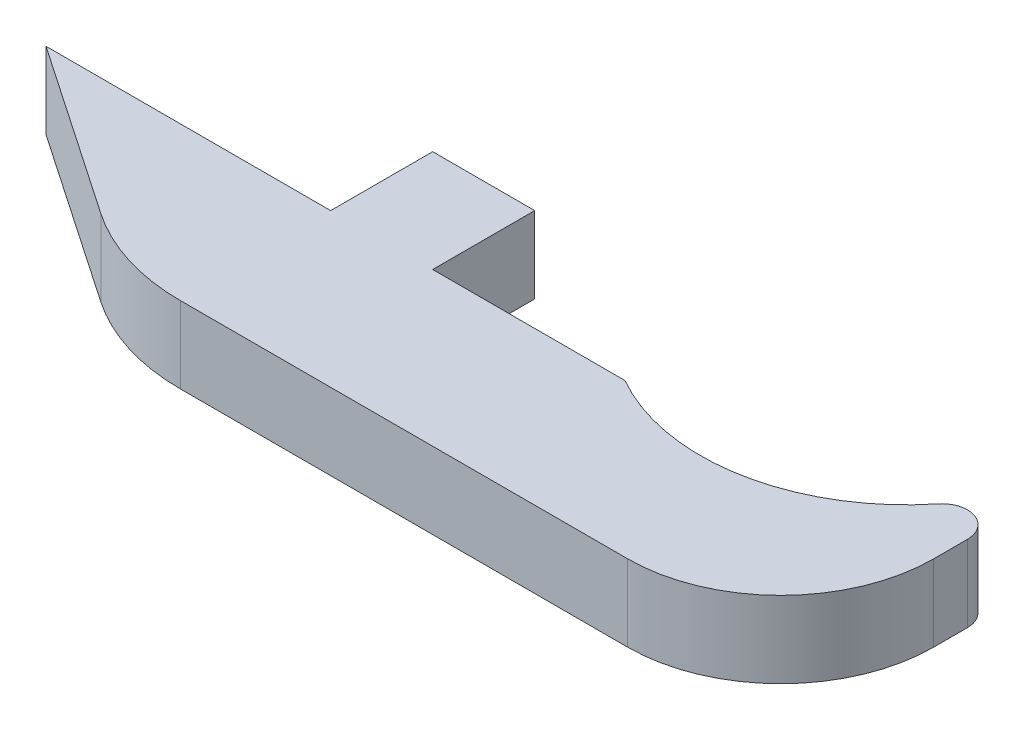
ISO-10303-21;
HEADER;
FILE_DESCRIPTION(('STEP AP214'),'2;1');
FILE_NAME('part.step','',(''),(''),'','','');
FILE_SCHEMA(('AUTOMOTIVE_DESIGN { 1 0 10303 214 1 1 1 1 }'));
ENDSEC;
DATA;
#1=APPLICATION_CONTEXT('core data for automotive mechanical design processes');
#2=APPLICATION_PROTOCOL_DEFINITION('international standard','automotive_design',2000,#1);
#3=PRODUCT_CONTEXT('',#1,'mechanical');
#4=PRODUCT('Part','Part','',(#3));
#5=PRODUCT_RELATED_PRODUCT_CATEGORY('part','',(#4));
#6=PRODUCT_DEFINITION_FORMATION('','',#4);
#7=PRODUCT_DEFINITION_CONTEXT('part definition',#1,'design');
#8=PRODUCT_DEFINITION('design','',#6,#7);
#9=PRODUCT_DEFINITION_SHAPE('','',#8);
#10=(LENGTH_UNIT() NAMED_UNIT(*) SI_UNIT(.MILLI.,.METRE.));
#11=(NAMED_UNIT(*) PLANE_ANGLE_UNIT() SI_UNIT($,.RADIAN.));
#12=(NAMED_UNIT(*) SI_UNIT($,.STERADIAN.) SOLID_ANGLE_UNIT());
#13=UNCERTAINTY_MEASURE_WITH_UNIT(LENGTH_MEASURE(1.E-05),#10,'distance_accuracy_value','');
#14=(GEOMETRIC_REPRESENTATION_CONTEXT(3) GLOBAL_UNCERTAINTY_ASSIGNED_CONTEXT((#13)) GLOBAL_UNIT_ASSIGNED_CONTEXT((#10,
#11,#12)) REPRESENTATION_CONTEXT('',''));
#15=CARTESIAN_POINT('',(0.,0.,0.));
#16=DIRECTION('',(0.,0.,1.));
#17=DIRECTION('',(1.,0.,0.));
#18=AXIS2_PLACEMENT_3D('',#15,#16,#17);
#19=CARTESIAN_POINT('',(0.,4.7625,0.));
#20=DIRECTION('',(0.,0.,1.));
#21=DIRECTION('',(1.,0.,0.));
#22=AXIS2_PLACEMENT_3D('',#19,#20,#21);
#23=PLANE('',#22);
#24=DIRECTION('',(-1.,0.,0.));
#25=VECTOR('',#24,1.);
#26=CARTESIAN_POINT('',(0.,0.,0.));
#27=LINE('',#26,#25);
#28=CARTESIAN_POINT('',(39.2084989263057,0.,0.));
#29=VERTEX_POINT('',#28);
#30=CARTESIAN_POINT('',(27.2395000000017,0.,0.));
#31=VERTEX_POINT('',#30);
#32=EDGE_CURVE('E177',#29,#31,#27,.T.);
#33=ORIENTED_EDGE('',*,*,#32,.T.);
#34=DIRECTION('',(0.,-1.,0.));
#35=VECTOR('',#34,1.);
#36=CARTESIAN_POINT('',(27.2395000000017,4.7625,0.));
#37=LINE('',#36,#35);
#38=CARTESIAN_POINT('',(27.2395000000017,4.7625,0.));
#39=VERTEX_POINT('',#38);
#40=EDGE_CURVE('E58',#39,#31,#37,.T.);
#41=ORIENTED_EDGE('',*,*,#40,.F.);
#42=DIRECTION('',(-1.,0.,0.));
#43=VECTOR('',#42,1.);
#44=CARTESIAN_POINT('',(0.,4.7625,0.));
#45=LINE('',#44,#43);
#46=CARTESIAN_POINT('',(39.2084989263057,4.7625,0.));
#47=VERTEX_POINT('',#46);
#48=EDGE_CURVE('E165',#47,#39,#45,.T.);
#49=ORIENTED_EDGE('',*,*,#48,.F.);
#50=DIRECTION('',(0.,-1.,0.));
#51=VECTOR('',#50,1.);
#52=CARTESIAN_POINT('',(39.2084989263057,4.7625,0.));
#53=LINE('',#52,#51);
#54=EDGE_CURVE('E187',#47,#29,#53,.T.);
#55=ORIENTED_EDGE('',*,*,#54,.T.);
#56=EDGE_LOOP('',(#33,#41,#49,#55));
#57=FACE_BOUND('',#56,.T.);
#58=ADVANCED_FACE('F35',(#57),#23,.F.);
#59=CARTESIAN_POINT('',(45.5929999999997,4.7625,-11.1252));
#60=DIRECTION('',(0.,-1.,0.));
#61=DIRECTION('',(0.,0.,-1.));
#62=AXIS2_PLACEMENT_3D('',#59,#60,#61);
#63=CYLINDRICAL_SURFACE('',#62,12.827);
#64=CARTESIAN_POINT('',(45.5929999999997,4.7625,-11.1252));
#65=DIRECTION('',(0.,1.,0.));
#66=DIRECTION('',(0.,0.,1.));
#67=AXIS2_PLACEMENT_3D('',#64,#65,#66);
#68=CIRCLE('',#67,12.827);
#69=CARTESIAN_POINT('',(55.594669603524,4.7625,-3.09410205875077));
#70=VERTEX_POINT('',#69);
#71=EDGE_CURVE('E161',#47,#70,#68,.T.);
#72=ORIENTED_EDGE('',*,*,#71,.T.);
#73=DIRECTION('',(0.,-1.,0.));
#74=VECTOR('',#73,1.);
#75=CARTESIAN_POINT('',(55.594669603524,4.7625,-3.09410205875077));
#76=LINE('',#75,#74);
#77=CARTESIAN_POINT('',(55.594669603524,0.,-3.09410205875077));
#78=VERTEX_POINT('',#77);
#79=EDGE_CURVE('E201',#70,#78,#76,.T.);
#80=ORIENTED_EDGE('',*,*,#79,.T.);
#81=CARTESIAN_POINT('',(45.5929999999997,0.,-11.1252));
#82=DIRECTION('',(0.,1.,0.));
#83=DIRECTION('',(0.,0.,1.));
#84=AXIS2_PLACEMENT_3D('',#81,#82,#83);
#85=CIRCLE('',#84,12.827);
#86=EDGE_CURVE('E158',#29,#78,#85,.T.);
#87=ORIENTED_EDGE('',*,*,#86,.F.);
#88=ORIENTED_EDGE('',*,*,#54,.F.);
#89=EDGE_LOOP('',(#72,#80,#87,#88));
#90=FACE_BOUND('',#89,.T.);
#91=ADVANCED_FACE('F245',(#90),#63,.F.);
#92=CARTESIAN_POINT('',(20.8895000000017,4.7625,0.));
#93=VERTEX_POINT('',#92);
#94=CARTESIAN_POINT('',(3.17499999999972,4.7625,0.));
#95=VERTEX_POINT('',#94);
#96=EDGE_CURVE('E50',#93,#95,#45,.T.);
#97=ORIENTED_EDGE('',*,*,#96,.F.);
#98=DIRECTION('',(0.,-1.,0.));
#99=VECTOR('',#98,1.);
#100=CARTESIAN_POINT('',(20.8895000000017,4.7625,0.));
#101=LINE('',#100,#99);
#102=CARTESIAN_POINT('',(20.8895000000017,0.,0.));
#103=VERTEX_POINT('',#102);
#104=EDGE_CURVE('E145',#93,#103,#101,.T.);
#105=ORIENTED_EDGE('',*,*,#104,.T.);
#106=CARTESIAN_POINT('',(3.17499999999972,0.,0.));
#107=VERTEX_POINT('',#106);
#108=EDGE_CURVE('E176',#103,#107,#27,.T.);
#109=ORIENTED_EDGE('',*,*,#108,.T.);
#110=DIRECTION('',(0.,-1.,0.));
#111=VECTOR('',#110,1.);
#112=CARTESIAN_POINT('',(3.17499999999972,4.7625,0.));
#113=LINE('',#112,#111);
#114=EDGE_CURVE('E173',#95,#107,#113,.T.);
#115=ORIENTED_EDGE('',*,*,#114,.F.);
#116=EDGE_LOOP('',(#97,#105,#109,#115));
#117=FACE_BOUND('',#116,.T.);
#118=ADVANCED_FACE('F250',(#117),#23,.F.);
#119=CARTESIAN_POINT('',(1.00758110014093,4.7625,-1.47778561354006));
#120=DIRECTION('',(0.563336824641504,0.,-0.826227342807552));
#121=DIRECTION('',(-0.826227342807552,0.,-0.563336824641504));
#122=AXIS2_PLACEMENT_3D('',#119,#120,#121);
#123=PLANE('',#122);
#124=DIRECTION('',(0.826227342807552,0.,0.563336824641504));
#125=VECTOR('',#124,1.);
#126=CARTESIAN_POINT('',(1.00758110014093,0.,-1.47778561354006));
#127=LINE('',#126,#125);
#128=CARTESIAN_POINT('',(13.9081946386952,0.,7.31808725365592));
#129=VERTEX_POINT('',#128);
#130=EDGE_CURVE('E179',#107,#129,#127,.T.);
#131=ORIENTED_EDGE('',*,*,#130,.T.);
#132=DIRECTION('',(0.,-1.,0.));
#133=VECTOR('',#132,1.);
#134=CARTESIAN_POINT('',(13.9081946386952,4.7625,7.31808725365591));
#135=LINE('',#134,#133);
#136=CARTESIAN_POINT('',(13.9081946386952,4.7625,7.31808725365592));
#137=VERTEX_POINT('',#136);
#138=EDGE_CURVE('E43',#129,#137,#135,.F.);
#139=ORIENTED_EDGE('',*,*,#138,.T.);
#140=DIRECTION('',(0.826227342807552,0.,0.563336824641504));
#141=VECTOR('',#140,1.);
#142=CARTESIAN_POINT('',(1.00758110014093,4.7625,-1.47778561354006));
#143=LINE('',#142,#141);
#144=EDGE_CURVE('E167',#95,#137,#143,.T.);
#145=ORIENTED_EDGE('',*,*,#144,.F.);
#146=ORIENTED_EDGE('',*,*,#114,.T.);
#147=EDGE_LOOP('',(#131,#139,#145,#146));
#148=FACE_BOUND('',#147,.T.);
#149=ADVANCED_FACE('F217',(#148),#123,.F.);
#150=CARTESIAN_POINT('',(0.,4.7625,9.525));
#151=DIRECTION('',(0.,0.,-1.));
#152=DIRECTION('',(-1.,0.,0.));
#153=AXIS2_PLACEMENT_3D('',#150,#151,#152);
#154=PLANE('',#153);
#155=DIRECTION('',(1.,0.,0.));
#156=VECTOR('',#155,1.);
#157=CARTESIAN_POINT('',(0.,4.7625,9.525));
#158=LINE('',#157,#156);
#159=CARTESIAN_POINT('',(21.0625723116423,4.7625,9.525));
#160=VERTEX_POINT('',#159);
#161=CARTESIAN_POINT('',(48.8949999999998,4.7625,9.525));
#162=VERTEX_POINT('',#161);
#163=EDGE_CURVE('E169',#160,#162,#158,.T.);
#164=ORIENTED_EDGE('',*,*,#163,.F.);
#165=DIRECTION('',(0.,-1.,0.));
#166=VECTOR('',#165,1.);
#167=CARTESIAN_POINT('',(21.0625723116423,4.7625,9.525));
#168=LINE('',#167,#166);
#169=CARTESIAN_POINT('',(21.0625723116423,0.,9.525));
#170=VERTEX_POINT('',#169);
#171=EDGE_CURVE('E210',#160,#170,#168,.T.);
#172=ORIENTED_EDGE('',*,*,#171,.T.);
#173=DIRECTION('',(1.,0.,0.));
#174=VECTOR('',#173,1.);
#175=CARTESIAN_POINT('',(0.,0.,9.525));
#176=LINE('',#175,#174);
#177=CARTESIAN_POINT('',(48.8949999999998,0.,9.525));
#178=VERTEX_POINT('',#177);
#179=EDGE_CURVE('E182',#170,#178,#176,.T.);
#180=ORIENTED_EDGE('',*,*,#179,.T.);
#181=DIRECTION('',(0.,-1.,0.));
#182=VECTOR('',#181,1.);
#183=CARTESIAN_POINT('',(48.8949999999998,4.7625,9.525));
#184=LINE('',#183,#182);
#185=EDGE_CURVE('E195',#178,#162,#184,.F.);
#186=ORIENTED_EDGE('',*,*,#185,.T.);
#187=EDGE_LOOP('',(#164,#172,#180,#186));
#188=FACE_BOUND('',#187,.T.);
#189=ADVANCED_FACE('F225',(#188),#154,.F.);
#190=CARTESIAN_POINT('',(58.4199999999998,4.7625,-6.08540141880177E-13));
#191=DIRECTION('',(1.,0.,0.));
#192=DIRECTION('',(0.,0.,-1.));
#193=AXIS2_PLACEMENT_3D('',#190,#191,#192);
#194=PLANE('',#193);
#195=DIRECTION('',(0.,0.,1.));
#196=VECTOR('',#195,1.);
#197=CARTESIAN_POINT('',(58.4199999999998,0.,-6.08540141880177E-13));
#198=LINE('',#197,#196);
#199=CARTESIAN_POINT('',(58.4199999999998,0.,-2.10015429374469));
#200=VERTEX_POINT('',#199);
#201=CARTESIAN_POINT('',(58.4199999999998,0.,-6.08540141880177E-13));
#202=VERTEX_POINT('',#201);
#203=EDGE_CURVE('E164',#200,#202,#198,.T.);
#204=ORIENTED_EDGE('',*,*,#203,.F.);
#205=DIRECTION('',(0.,-1.,0.));
#206=VECTOR('',#205,1.);
#207=CARTESIAN_POINT('',(58.4199999999998,4.7625,-2.10015429374469));
#208=LINE('',#207,#206);
#209=CARTESIAN_POINT('',(58.4199999999998,4.7625,-2.10015429374469));
#210=VERTEX_POINT('',#209);
#211=EDGE_CURVE('E206',#200,#210,#208,.F.);
#212=ORIENTED_EDGE('',*,*,#211,.T.);
#213=DIRECTION('',(0.,0.,1.));
#214=VECTOR('',#213,1.);
#215=CARTESIAN_POINT('',(58.4199999999998,4.7625,-6.08540141880177E-13));
#216=LINE('',#215,#214);
#217=CARTESIAN_POINT('',(58.4199999999998,4.7625,-6.08540141880177E-13));
#218=VERTEX_POINT('',#217);
#219=EDGE_CURVE('E171',#210,#218,#216,.T.);
#220=ORIENTED_EDGE('',*,*,#219,.T.);
#221=DIRECTION('',(0.,-1.,0.));
#222=VECTOR('',#221,1.);
#223=CARTESIAN_POINT('',(58.4199999999998,0.,-6.08540141880177E-13));
#224=LINE('',#223,#222);
#225=EDGE_CURVE('E189',#218,#202,#224,.T.);
#226=ORIENTED_EDGE('',*,*,#225,.T.);
#227=EDGE_LOOP('',(#204,#212,#220,#226));
#228=FACE_BOUND('',#227,.T.);
#229=ADVANCED_FACE('F277',(#228),#194,.T.);
#230=CARTESIAN_POINT('',(0.,4.7625,0.));
#231=DIRECTION('',(0.,1.,0.));
#232=DIRECTION('',(0.,0.,1.));
#233=AXIS2_PLACEMENT_3D('',#230,#231,#232);
#234=PLANE('',#233);
#235=ORIENTED_EDGE('',*,*,#144,.T.);
#236=CARTESIAN_POINT('',(21.0625723116423,4.7625,-3.175));
#237=DIRECTION('',(0.,1.,0.));
#238=DIRECTION('',(0.,0.,1.));
#239=AXIS2_PLACEMENT_3D('',#236,#237,#238);
#240=CIRCLE('',#239,12.7);
#241=EDGE_CURVE('E11',#137,#160,#240,.T.);
#242=ORIENTED_EDGE('',*,*,#241,.T.);
#243=ORIENTED_EDGE('',*,*,#163,.T.);
#244=CARTESIAN_POINT('',(48.8949999999998,4.7625,-5.0932164048667E-13));
#245=DIRECTION('',(0.,1.,0.));
#246=DIRECTION('',(0.,0.,1.));
#247=AXIS2_PLACEMENT_3D('',#244,#245,#246);
#248=CIRCLE('',#247,9.525);
#249=EDGE_CURVE('E198',#162,#218,#248,.T.);
#250=ORIENTED_EDGE('',*,*,#249,.T.);
#251=ORIENTED_EDGE('',*,*,#219,.F.);
#252=CARTESIAN_POINT('',(56.8324999999998,4.7625,-2.10015429374468));
#253=DIRECTION('',(0.,1.,0.));
#254=DIRECTION('',(0.,0.,1.));
#255=AXIS2_PLACEMENT_3D('',#252,#253,#254);
#256=CIRCLE('',#255,1.5875);
#257=EDGE_CURVE('E208',#210,#70,#256,.T.);
#258=ORIENTED_EDGE('',*,*,#257,.T.);
#259=ORIENTED_EDGE('',*,*,#71,.F.);
#260=ORIENTED_EDGE('',*,*,#48,.T.);
#261=DIRECTION('',(0.,0.,1.));
#262=VECTOR('',#261,1.);
#263=CARTESIAN_POINT('',(27.2395000000017,4.7625,0.));
#264=LINE('',#263,#262);
#265=CARTESIAN_POINT('',(27.2395000000017,4.7625,-6.35000000000222));
#266=VERTEX_POINT('',#265);
#267=EDGE_CURVE('E133',#266,#39,#264,.T.);
#268=ORIENTED_EDGE('',*,*,#267,.F.);
#269=DIRECTION('',(-1.,0.,0.));
#270=VECTOR('',#269,1.);
#271=CARTESIAN_POINT('',(0.,4.7625,-6.35000000000222));
#272=LINE('',#271,#270);
#273=CARTESIAN_POINT('',(20.8895000000017,4.7625,-6.35000000000222));
#274=VERTEX_POINT('',#273);
#275=EDGE_CURVE('E126',#266,#274,#272,.T.);
#276=ORIENTED_EDGE('',*,*,#275,.T.);
#277=DIRECTION('',(0.,0.,-1.));
#278=VECTOR('',#277,1.);
#279=CARTESIAN_POINT('',(20.8895000000017,4.7625,0.));
#280=LINE('',#279,#278);
#281=EDGE_CURVE('E131',#93,#274,#280,.T.);
#282=ORIENTED_EDGE('',*,*,#281,.F.);
#283=ORIENTED_EDGE('',*,*,#96,.T.);
#284=EDGE_LOOP('',(#235,#242,#243,#250,#251,#258,#259,#260,#268,#276,#282,#283));
#285=FACE_BOUND('',#284,.T.);
#286=ADVANCED_FACE('F129',(#285),#234,.T.);
#287=CARTESIAN_POINT('',(0.,0.,0.));
#288=DIRECTION('',(0.,1.,0.));
#289=DIRECTION('',(0.,0.,1.));
#290=AXIS2_PLACEMENT_3D('',#287,#288,#289);
#291=PLANE('',#290);
#292=ORIENTED_EDGE('',*,*,#179,.F.);
#293=CARTESIAN_POINT('',(21.0625723116423,0.,-3.175));
#294=DIRECTION('',(0.,1.,0.));
#295=DIRECTION('',(0.,0.,1.));
#296=AXIS2_PLACEMENT_3D('',#293,#294,#295);
#297=CIRCLE('',#296,12.7);
#298=EDGE_CURVE('E213',#170,#129,#297,.F.);
#299=ORIENTED_EDGE('',*,*,#298,.T.);
#300=ORIENTED_EDGE('',*,*,#130,.F.);
#301=ORIENTED_EDGE('',*,*,#108,.F.);
#302=DIRECTION('',(0.,0.,-1.));
#303=VECTOR('',#302,1.);
#304=CARTESIAN_POINT('',(20.8895000000017,0.,0.));
#305=LINE('',#304,#303);
#306=CARTESIAN_POINT('',(20.8895000000017,0.,-6.35000000000222));
#307=VERTEX_POINT('',#306);
#308=EDGE_CURVE('E154',#103,#307,#305,.T.);
#309=ORIENTED_EDGE('',*,*,#308,.T.);
#310=DIRECTION('',(-1.,0.,0.));
#311=VECTOR('',#310,1.);
#312=CARTESIAN_POINT('',(0.,0.,-6.35000000000222));
#313=LINE('',#312,#311);
#314=CARTESIAN_POINT('',(27.2395000000017,0.,-6.35000000000222));
#315=VERTEX_POINT('',#314);
#316=EDGE_CURVE('E140',#315,#307,#313,.T.);
#317=ORIENTED_EDGE('',*,*,#316,.F.);
#318=DIRECTION('',(0.,0.,1.));
#319=VECTOR('',#318,1.);
#320=CARTESIAN_POINT('',(27.2395000000017,0.,0.));
#321=LINE('',#320,#319);
#322=EDGE_CURVE('E148',#315,#31,#321,.T.);
#323=ORIENTED_EDGE('',*,*,#322,.T.);
#324=ORIENTED_EDGE('',*,*,#32,.F.);
#325=ORIENTED_EDGE('',*,*,#86,.T.);
#326=CARTESIAN_POINT('',(56.8324999999998,0.,-2.10015429374468));
#327=DIRECTION('',(0.,1.,0.));
#328=DIRECTION('',(0.,0.,1.));
#329=AXIS2_PLACEMENT_3D('',#326,#327,#328);
#330=CIRCLE('',#329,1.5875);
#331=EDGE_CURVE('E204',#78,#200,#330,.F.);
#332=ORIENTED_EDGE('',*,*,#331,.T.);
#333=ORIENTED_EDGE('',*,*,#203,.T.);
#334=CARTESIAN_POINT('',(48.8949999999998,0.,-5.0932164048667E-13));
#335=DIRECTION('',(0.,1.,0.));
#336=DIRECTION('',(0.,0.,1.));
#337=AXIS2_PLACEMENT_3D('',#334,#335,#336);
#338=CIRCLE('',#337,9.525);
#339=EDGE_CURVE('E192',#202,#178,#338,.F.);
#340=ORIENTED_EDGE('',*,*,#339,.T.);
#341=EDGE_LOOP('',(#292,#299,#300,#301,#309,#317,#323,#324,#325,#332,#333,#340));
#342=FACE_BOUND('',#341,.T.);
#343=ADVANCED_FACE('F227',(#342),#291,.F.);
#344=CARTESIAN_POINT('',(48.8949999999998,4.7625,-5.0932164048667E-13));
#345=DIRECTION('',(0.,1.,0.));
#346=DIRECTION('',(0.,0.,1.));
#347=AXIS2_PLACEMENT_3D('',#344,#345,#346);
#348=CYLINDRICAL_SURFACE('',#347,9.525);
#349=ORIENTED_EDGE('',*,*,#249,.F.);
#350=ORIENTED_EDGE('',*,*,#185,.F.);
#351=ORIENTED_EDGE('',*,*,#339,.F.);
#352=ORIENTED_EDGE('',*,*,#225,.F.);
#353=EDGE_LOOP('',(#349,#350,#351,#352));
#354=FACE_BOUND('',#353,.T.);
#355=ADVANCED_FACE('F234',(#354),#348,.T.);
#356=CARTESIAN_POINT('',(56.8324999999998,4.7625,-2.10015429374468));
#357=DIRECTION('',(0.,-1.,0.));
#358=DIRECTION('',(0.,0.,-1.));
#359=AXIS2_PLACEMENT_3D('',#356,#357,#358);
#360=CYLINDRICAL_SURFACE('',#359,1.5875);
#361=ORIENTED_EDGE('',*,*,#257,.F.);
#362=ORIENTED_EDGE('',*,*,#211,.F.);
#363=ORIENTED_EDGE('',*,*,#331,.F.);
#364=ORIENTED_EDGE('',*,*,#79,.F.);
#365=EDGE_LOOP('',(#361,#362,#363,#364));
#366=FACE_BOUND('',#365,.T.);
#367=ADVANCED_FACE('F242',(#366),#360,.T.);
#368=CARTESIAN_POINT('',(21.0625723116423,4.7625,-3.175));
#369=DIRECTION('',(0.,-1.,0.));
#370=DIRECTION('',(0.,0.,-1.));
#371=AXIS2_PLACEMENT_3D('',#368,#369,#370);
#372=CYLINDRICAL_SURFACE('',#371,12.7);
#373=ORIENTED_EDGE('',*,*,#241,.F.);
#374=ORIENTED_EDGE('',*,*,#138,.F.);
#375=ORIENTED_EDGE('',*,*,#298,.F.);
#376=ORIENTED_EDGE('',*,*,#171,.F.);
#377=EDGE_LOOP('',(#373,#374,#375,#376));
#378=FACE_BOUND('',#377,.T.);
#379=ADVANCED_FACE('F37',(#378),#372,.T.);
#380=CARTESIAN_POINT('',(27.2395000000017,4.7625,0.));
#381=DIRECTION('',(1.,0.,0.));
#382=DIRECTION('',(0.,0.,-1.));
#383=AXIS2_PLACEMENT_3D('',#380,#381,#382);
#384=PLANE('',#383);
#385=ORIENTED_EDGE('',*,*,#322,.F.);
#386=DIRECTION('',(0.,-1.,0.));
#387=VECTOR('',#386,1.);
#388=CARTESIAN_POINT('',(27.2395000000017,4.7625,-6.35000000000222));
#389=LINE('',#388,#387);
#390=EDGE_CURVE('E144',#266,#315,#389,.T.);
#391=ORIENTED_EDGE('',*,*,#390,.F.);
#392=ORIENTED_EDGE('',*,*,#267,.T.);
#393=ORIENTED_EDGE('',*,*,#40,.T.);
#394=EDGE_LOOP('',(#385,#391,#392,#393));
#395=FACE_BOUND('',#394,.T.);
#396=ADVANCED_FACE('F249',(#395),#384,.T.);
#397=CARTESIAN_POINT('',(0.,4.7625,-6.35000000000222));
#398=DIRECTION('',(0.,0.,1.));
#399=DIRECTION('',(1.,0.,0.));
#400=AXIS2_PLACEMENT_3D('',#397,#398,#399);
#401=PLANE('',#400);
#402=ORIENTED_EDGE('',*,*,#316,.T.);
#403=DIRECTION('',(0.,-1.,0.));
#404=VECTOR('',#403,1.);
#405=CARTESIAN_POINT('',(20.8895000000017,4.7625,-6.35000000000222));
#406=LINE('',#405,#404);
#407=EDGE_CURVE('E137',#274,#307,#406,.T.);
#408=ORIENTED_EDGE('',*,*,#407,.F.);
#409=ORIENTED_EDGE('',*,*,#275,.F.);
#410=ORIENTED_EDGE('',*,*,#390,.T.);
#411=EDGE_LOOP('',(#402,#408,#409,#410));
#412=FACE_BOUND('',#411,.T.);
#413=ADVANCED_FACE('F138',(#412),#401,.F.);
#414=CARTESIAN_POINT('',(20.8895000000017,4.7625,0.));
#415=DIRECTION('',(-1.,0.,0.));
#416=DIRECTION('',(0.,0.,1.));
#417=AXIS2_PLACEMENT_3D('',#414,#415,#416);
#418=PLANE('',#417);
#419=ORIENTED_EDGE('',*,*,#308,.F.);
#420=ORIENTED_EDGE('',*,*,#104,.F.);
#421=ORIENTED_EDGE('',*,*,#281,.T.);
#422=ORIENTED_EDGE('',*,*,#407,.T.);
#423=EDGE_LOOP('',(#419,#420,#421,#422));
#424=FACE_BOUND('',#423,.T.);
#425=ADVANCED_FACE('F147',(#424),#418,.T.);
#426=CLOSED_SHELL('',(#58,#91,#118,#149,#189,#229,#286,#343,#355,#367,#379,#396,#413,#425));
#427=MANIFOLD_SOLID_BREP('B2',#426);
#428=ADVANCED_BREP_SHAPE_REPRESENTATION('',(#18,#427),#14);
#429=SHAPE_DEFINITION_REPRESENTATION(#9,#428);
ENDSEC;
END-ISO-10303-21;
